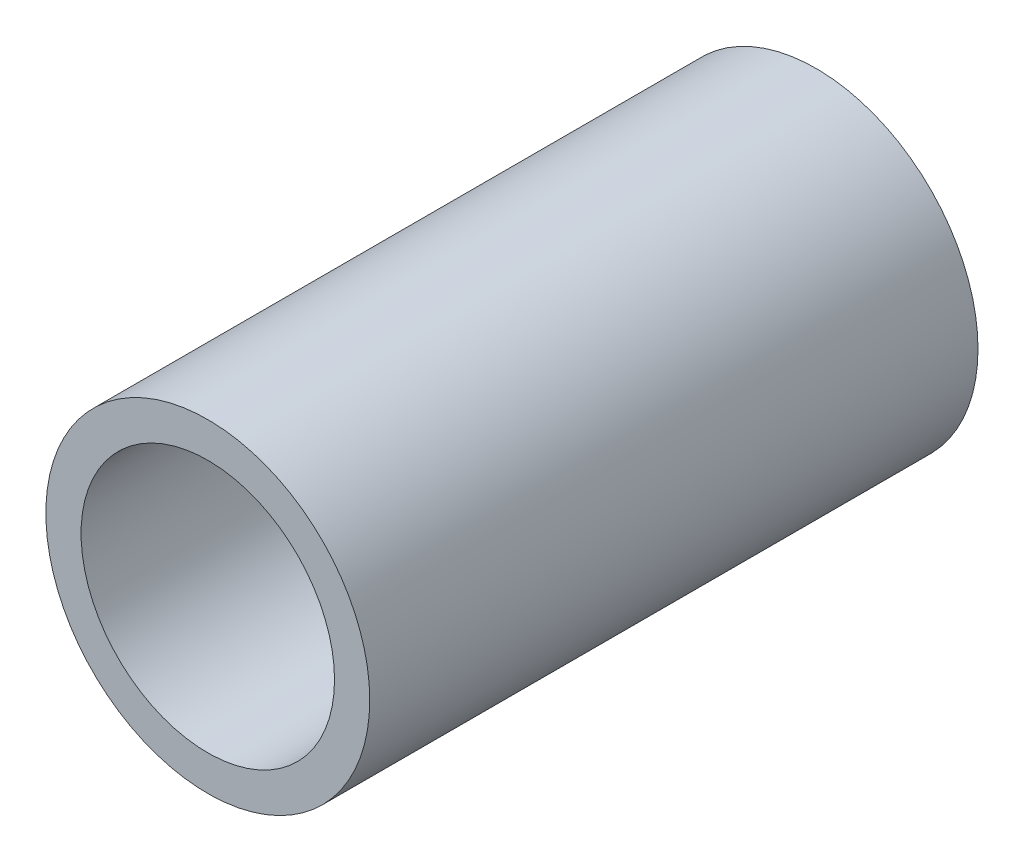
ISO-10303-21;
HEADER;
FILE_DESCRIPTION(('STEP AP214'),'2;1');
FILE_NAME('part.step','',(''),(''),'','','');
FILE_SCHEMA(('AUTOMOTIVE_DESIGN { 1 0 10303 214 1 1 1 1 }'));
ENDSEC;
DATA;
#1=APPLICATION_CONTEXT('core data for automotive mechanical design processes');
#2=APPLICATION_PROTOCOL_DEFINITION('international standard','automotive_design',2000,#1);
#3=PRODUCT_CONTEXT('',#1,'mechanical');
#4=PRODUCT('Part','Part','',(#3));
#5=PRODUCT_RELATED_PRODUCT_CATEGORY('part','',(#4));
#6=PRODUCT_DEFINITION_FORMATION('','',#4);
#7=PRODUCT_DEFINITION_CONTEXT('part definition',#1,'design');
#8=PRODUCT_DEFINITION('design','',#6,#7);
#9=PRODUCT_DEFINITION_SHAPE('','',#8);
#10=(LENGTH_UNIT() NAMED_UNIT(*) SI_UNIT(.MILLI.,.METRE.));
#11=(NAMED_UNIT(*) PLANE_ANGLE_UNIT() SI_UNIT($,.RADIAN.));
#12=(NAMED_UNIT(*) SI_UNIT($,.STERADIAN.) SOLID_ANGLE_UNIT());
#13=UNCERTAINTY_MEASURE_WITH_UNIT(LENGTH_MEASURE(1.E-05),#10,'distance_accuracy_value','');
#14=(GEOMETRIC_REPRESENTATION_CONTEXT(3) GLOBAL_UNCERTAINTY_ASSIGNED_CONTEXT((#13)) GLOBAL_UNIT_ASSIGNED_CONTEXT((#10,
#11,#12)) REPRESENTATION_CONTEXT('',''));
#15=CARTESIAN_POINT('',(0.,0.,0.));
#16=DIRECTION('',(0.,0.,1.));
#17=DIRECTION('',(1.,0.,0.));
#18=AXIS2_PLACEMENT_3D('',#15,#16,#17);
#19=CARTESIAN_POINT('',(-7.47350051174752,0.,60.));
#20=DIRECTION('',(0.,0.,1.));
#21=DIRECTION('',(1.,0.,0.));
#22=AXIS2_PLACEMENT_3D('',#19,#20,#21);
#23=PLANE('',#22);
#24=CARTESIAN_POINT('',(-7.47350051174752,0.,60.));
#25=DIRECTION('',(0.,0.,1.));
#26=DIRECTION('',(1.,0.,0.));
#27=AXIS2_PLACEMENT_3D('',#24,#25,#26);
#28=CIRCLE('',#27,15.975);
#29=CARTESIAN_POINT('',(8.50149948825248,0.,60.));
#30=VERTEX_POINT('',#29);
#31=EDGE_CURVE('E10',#30,#30,#28,.T.);
#32=ORIENTED_EDGE('',*,*,#31,.T.);
#33=EDGE_LOOP('',(#32));
#34=FACE_BOUND('',#33,.T.);
#35=CARTESIAN_POINT('',(-7.47350051174752,0.,60.));
#36=DIRECTION('',(0.,0.,1.));
#37=DIRECTION('',(1.,0.,0.));
#38=AXIS2_PLACEMENT_3D('',#35,#36,#37);
#39=CIRCLE('',#38,12.5);
#40=CARTESIAN_POINT('',(5.02649948825248,0.,60.));
#41=VERTEX_POINT('',#40);
#42=EDGE_CURVE('E43',#41,#41,#39,.T.);
#43=ORIENTED_EDGE('',*,*,#42,.F.);
#44=EDGE_LOOP('',(#43));
#45=FACE_BOUND('',#44,.T.);
#46=ADVANCED_FACE('F32',(#34,#45),#23,.T.);
#47=CARTESIAN_POINT('',(-7.47350051174752,0.,0.));
#48=DIRECTION('',(0.,0.,1.));
#49=DIRECTION('',(1.,0.,0.));
#50=AXIS2_PLACEMENT_3D('',#47,#48,#49);
#51=PLANE('',#50);
#52=CARTESIAN_POINT('',(-7.47350051174752,0.,0.));
#53=DIRECTION('',(0.,0.,1.));
#54=DIRECTION('',(1.,0.,0.));
#55=AXIS2_PLACEMENT_3D('',#52,#53,#54);
#56=CIRCLE('',#55,15.975);
#57=CARTESIAN_POINT('',(8.50149948825248,0.,0.));
#58=VERTEX_POINT('',#57);
#59=EDGE_CURVE('E36',#58,#58,#56,.T.);
#60=ORIENTED_EDGE('',*,*,#59,.F.);
#61=EDGE_LOOP('',(#60));
#62=FACE_BOUND('',#61,.T.);
#63=CARTESIAN_POINT('',(-7.47350051174752,0.,0.));
#64=DIRECTION('',(0.,0.,1.));
#65=DIRECTION('',(1.,0.,0.));
#66=AXIS2_PLACEMENT_3D('',#63,#64,#65);
#67=CIRCLE('',#66,12.5);
#68=CARTESIAN_POINT('',(5.02649948825248,0.,0.));
#69=VERTEX_POINT('',#68);
#70=EDGE_CURVE('E45',#69,#69,#67,.T.);
#71=ORIENTED_EDGE('',*,*,#70,.T.);
#72=EDGE_LOOP('',(#71));
#73=FACE_BOUND('',#72,.T.);
#74=ADVANCED_FACE('F55',(#62,#73),#51,.F.);
#75=CARTESIAN_POINT('',(-7.47350051174752,0.,60.));
#76=DIRECTION('',(0.,0.,-1.));
#77=DIRECTION('',(-1.,0.,0.));
#78=AXIS2_PLACEMENT_3D('',#75,#76,#77);
#79=CYLINDRICAL_SURFACE('',#78,15.975);
#80=ORIENTED_EDGE('',*,*,#31,.F.);
#81=EDGE_LOOP('',(#80));
#82=FACE_BOUND('',#81,.T.);
#83=ORIENTED_EDGE('',*,*,#59,.T.);
#84=EDGE_LOOP('',(#83));
#85=FACE_BOUND('',#84,.T.);
#86=ADVANCED_FACE('F34',(#82,#85),#79,.T.);
#87=CARTESIAN_POINT('',(-7.47350051174752,0.,60.));
#88=DIRECTION('',(0.,0.,-1.));
#89=DIRECTION('',(-1.,0.,0.));
#90=AXIS2_PLACEMENT_3D('',#87,#88,#89);
#91=CYLINDRICAL_SURFACE('',#90,12.5);
#92=ORIENTED_EDGE('',*,*,#42,.T.);
#93=EDGE_LOOP('',(#92));
#94=FACE_BOUND('',#93,.T.);
#95=ORIENTED_EDGE('',*,*,#70,.F.);
#96=EDGE_LOOP('',(#95));
#97=FACE_BOUND('',#96,.T.);
#98=ADVANCED_FACE('F51',(#94,#97),#91,.F.);
#99=CLOSED_SHELL('',(#46,#74,#86,#98));
#100=MANIFOLD_SOLID_BREP('B2',#99);
#101=ADVANCED_BREP_SHAPE_REPRESENTATION('',(#18,#100),#14);
#102=SHAPE_DEFINITION_REPRESENTATION(#9,#101);
ENDSEC;
END-ISO-10303-21;
